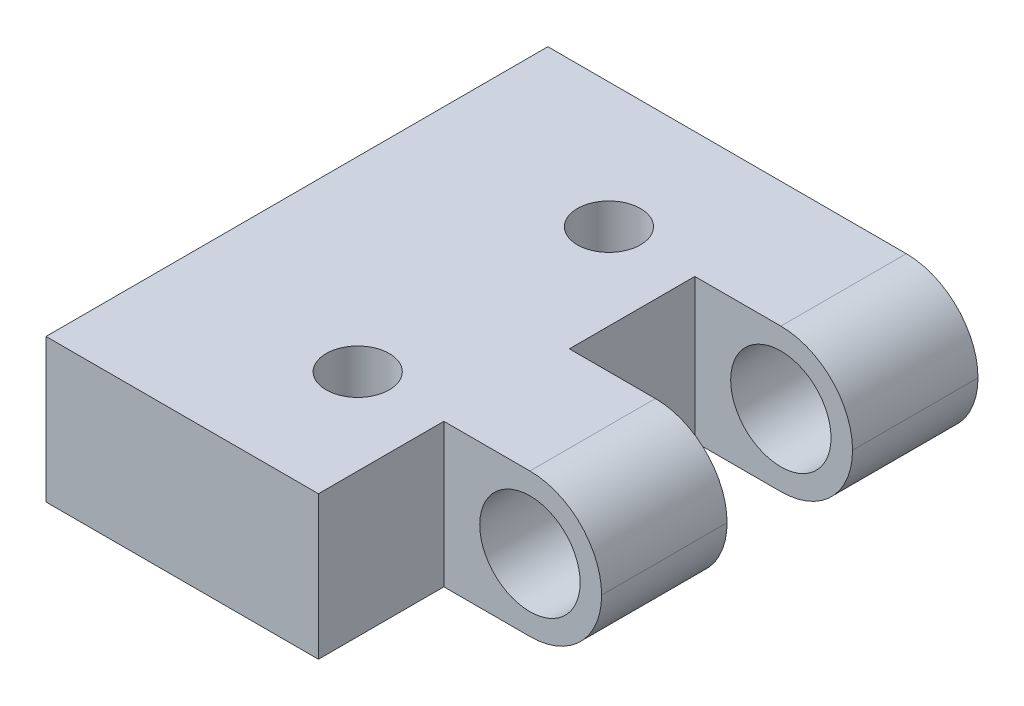
ISO-10303-21;
HEADER;
FILE_DESCRIPTION(('STEP AP214'),'2;1');
FILE_NAME('part.step','',(''),(''),'','','');
FILE_SCHEMA(('AUTOMOTIVE_DESIGN { 1 0 10303 214 1 1 1 1 }'));
ENDSEC;
DATA;
#1=APPLICATION_CONTEXT('core data for automotive mechanical design processes');
#2=APPLICATION_PROTOCOL_DEFINITION('international standard','automotive_design',2000,#1);
#3=PRODUCT_CONTEXT('',#1,'mechanical');
#4=PRODUCT('Part','Part','',(#3));
#5=PRODUCT_RELATED_PRODUCT_CATEGORY('part','',(#4));
#6=PRODUCT_DEFINITION_FORMATION('','',#4);
#7=PRODUCT_DEFINITION_CONTEXT('part definition',#1,'design');
#8=PRODUCT_DEFINITION('design','',#6,#7);
#9=PRODUCT_DEFINITION_SHAPE('','',#8);
#10=(LENGTH_UNIT() NAMED_UNIT(*) SI_UNIT(.MILLI.,.METRE.));
#11=(NAMED_UNIT(*) PLANE_ANGLE_UNIT() SI_UNIT($,.RADIAN.));
#12=(NAMED_UNIT(*) SI_UNIT($,.STERADIAN.) SOLID_ANGLE_UNIT());
#13=UNCERTAINTY_MEASURE_WITH_UNIT(LENGTH_MEASURE(1.E-05),#10,'distance_accuracy_value','');
#14=(GEOMETRIC_REPRESENTATION_CONTEXT(3) GLOBAL_UNCERTAINTY_ASSIGNED_CONTEXT((#13)) GLOBAL_UNIT_ASSIGNED_CONTEXT((#10,
#11,#12)) REPRESENTATION_CONTEXT('',''));
#15=CARTESIAN_POINT('',(0.,0.,0.));
#16=DIRECTION('',(0.,0.,1.));
#17=DIRECTION('',(1.,0.,0.));
#18=AXIS2_PLACEMENT_3D('',#15,#16,#17);
#19=CARTESIAN_POINT('',(0.,0.,0.));
#20=DIRECTION('',(0.,-1.,0.));
#21=DIRECTION('',(0.,0.,-1.));
#22=AXIS2_PLACEMENT_3D('',#19,#20,#21);
#23=PLANE('',#22);
#24=DIRECTION('',(0.,0.,1.));
#25=VECTOR('',#24,1.);
#26=CARTESIAN_POINT('',(12.065,0.,0.));
#27=LINE('',#26,#25);
#28=CARTESIAN_POINT('',(12.065,0.,-5.55625));
#29=VERTEX_POINT('',#28);
#30=CARTESIAN_POINT('',(12.065,0.,0.));
#31=VERTEX_POINT('',#30);
#32=EDGE_CURVE('E136',#29,#31,#27,.T.);
#33=ORIENTED_EDGE('',*,*,#32,.T.);
#34=DIRECTION('',(1.,0.,0.));
#35=VECTOR('',#34,1.);
#36=CARTESIAN_POINT('',(0.,0.,0.));
#37=LINE('',#36,#35);
#38=CARTESIAN_POINT('',(0.,0.,0.));
#39=VERTEX_POINT('',#38);
#40=EDGE_CURVE('E150',#39,#31,#37,.T.);
#41=ORIENTED_EDGE('',*,*,#40,.F.);
#42=DIRECTION('',(0.,0.,1.));
#43=VECTOR('',#42,1.);
#44=CARTESIAN_POINT('',(0.,0.,0.));
#45=LINE('',#44,#43);
#46=CARTESIAN_POINT('',(0.,0.,-22.225));
#47=VERTEX_POINT('',#46);
#48=EDGE_CURVE('E162',#47,#39,#45,.T.);
#49=ORIENTED_EDGE('',*,*,#48,.F.);
#50=DIRECTION('',(-1.,0.,0.));
#51=VECTOR('',#50,1.);
#52=CARTESIAN_POINT('',(0.,0.,-22.225));
#53=LINE('',#52,#51);
#54=CARTESIAN_POINT('',(15.875,0.,-22.225));
#55=VERTEX_POINT('',#54);
#56=EDGE_CURVE('E161',#55,#47,#53,.T.);
#57=ORIENTED_EDGE('',*,*,#56,.F.);
#58=DIRECTION('',(0.,0.,-1.));
#59=VECTOR('',#58,1.);
#60=CARTESIAN_POINT('',(15.875,0.,0.));
#61=LINE('',#60,#59);
#62=CARTESIAN_POINT('',(15.875,0.,-16.66875));
#63=VERTEX_POINT('',#62);
#64=EDGE_CURVE('E191',#55,#63,#61,.F.);
#65=ORIENTED_EDGE('',*,*,#64,.T.);
#66=DIRECTION('',(-1.,0.,0.));
#67=VECTOR('',#66,1.);
#68=CARTESIAN_POINT('',(12.065,0.,-16.66875));
#69=LINE('',#68,#67);
#70=CARTESIAN_POINT('',(12.065,0.,-16.66875));
#71=VERTEX_POINT('',#70);
#72=EDGE_CURVE('E267',#63,#71,#69,.T.);
#73=ORIENTED_EDGE('',*,*,#72,.T.);
#74=DIRECTION('',(0.,0.,1.));
#75=VECTOR('',#74,1.);
#76=CARTESIAN_POINT('',(12.065,0.,-11.1125));
#77=LINE('',#76,#75);
#78=CARTESIAN_POINT('',(12.065,0.,-11.1125));
#79=VERTEX_POINT('',#78);
#80=EDGE_CURVE('E222',#71,#79,#77,.T.);
#81=ORIENTED_EDGE('',*,*,#80,.T.);
#82=DIRECTION('',(1.,0.,0.));
#83=VECTOR('',#82,1.);
#84=CARTESIAN_POINT('',(12.065,0.,-11.1125));
#85=LINE('',#84,#83);
#86=CARTESIAN_POINT('',(15.875,0.,-11.1125));
#87=VERTEX_POINT('',#86);
#88=EDGE_CURVE('E263',#79,#87,#85,.T.);
#89=ORIENTED_EDGE('',*,*,#88,.T.);
#90=CARTESIAN_POINT('',(15.875,0.,-5.55625));
#91=VERTEX_POINT('',#90);
#92=EDGE_CURVE('E190',#87,#91,#61,.F.);
#93=ORIENTED_EDGE('',*,*,#92,.T.);
#94=DIRECTION('',(-1.,0.,0.));
#95=VECTOR('',#94,1.);
#96=CARTESIAN_POINT('',(12.065,0.,-5.55625));
#97=LINE('',#96,#95);
#98=EDGE_CURVE('E145',#91,#29,#97,.T.);
#99=ORIENTED_EDGE('',*,*,#98,.T.);
#100=EDGE_LOOP('',(#33,#41,#49,#57,#65,#73,#81,#89,#93,#99));
#101=FACE_BOUND('',#100,.T.);
#102=CARTESIAN_POINT('',(8.255,0.,-16.6751));
#103=DIRECTION('',(0.,1.,0.));
#104=DIRECTION('',(0.,0.,1.));
#105=AXIS2_PLACEMENT_3D('',#102,#103,#104);
#106=CIRCLE('',#105,1.397);
#107=CARTESIAN_POINT('',(8.255,0.,-15.2781));
#108=VERTEX_POINT('',#107);
#109=EDGE_CURVE('E279',#108,#108,#106,.T.);
#110=ORIENTED_EDGE('',*,*,#109,.T.);
#111=EDGE_LOOP('',(#110));
#112=FACE_BOUND('',#111,.T.);
#113=CARTESIAN_POINT('',(8.255,0.,-5.5499));
#114=DIRECTION('',(0.,1.,0.));
#115=DIRECTION('',(0.,0.,1.));
#116=AXIS2_PLACEMENT_3D('',#113,#114,#115);
#117=CIRCLE('',#116,1.397);
#118=CARTESIAN_POINT('',(8.255,0.,-4.1529));
#119=VERTEX_POINT('',#118);
#120=EDGE_CURVE('E297',#119,#119,#117,.T.);
#121=ORIENTED_EDGE('',*,*,#120,.T.);
#122=EDGE_LOOP('',(#121));
#123=FACE_BOUND('',#122,.T.);
#124=ADVANCED_FACE('F43',(#101,#112,#123),#23,.T.);
#125=CARTESIAN_POINT('',(15.875,3.175,-22.225));
#126=DIRECTION('',(0.,0.,1.));
#127=DIRECTION('',(1.,0.,0.));
#128=AXIS2_PLACEMENT_3D('',#125,#126,#127);
#129=CYLINDRICAL_SURFACE('',#128,2.2225);
#130=CARTESIAN_POINT('',(15.875,3.175,-16.66875));
#131=DIRECTION('',(0.,0.,-1.));
#132=DIRECTION('',(-1.,0.,0.));
#133=AXIS2_PLACEMENT_3D('',#130,#131,#132);
#134=CIRCLE('',#133,2.2225);
#135=CARTESIAN_POINT('',(13.6525,3.175,-16.66875));
#136=VERTEX_POINT('',#135);
#137=EDGE_CURVE('E247',#136,#136,#134,.F.);
#138=ORIENTED_EDGE('',*,*,#137,.T.);
#139=EDGE_LOOP('',(#138));
#140=FACE_BOUND('',#139,.T.);
#141=CARTESIAN_POINT('',(15.875,3.175,-22.225));
#142=DIRECTION('',(0.,0.,1.));
#143=DIRECTION('',(1.,0.,0.));
#144=AXIS2_PLACEMENT_3D('',#141,#142,#143);
#145=CIRCLE('',#144,2.2225);
#146=CARTESIAN_POINT('',(18.0975,3.175,-22.225));
#147=VERTEX_POINT('',#146);
#148=EDGE_CURVE('E168',#147,#147,#145,.T.);
#149=ORIENTED_EDGE('',*,*,#148,.F.);
#150=EDGE_LOOP('',(#149));
#151=FACE_BOUND('',#150,.T.);
#152=ADVANCED_FACE('F326',(#140,#151),#129,.F.);
#153=CARTESIAN_POINT('',(15.875,3.175,0.));
#154=DIRECTION('',(0.,0.,1.));
#155=DIRECTION('',(1.,0.,0.));
#156=AXIS2_PLACEMENT_3D('',#153,#154,#155);
#157=CYLINDRICAL_SURFACE('',#156,3.175);
#158=CARTESIAN_POINT('',(15.875,3.175,-16.66875));
#159=DIRECTION('',(0.,0.,-1.));
#160=DIRECTION('',(-1.,0.,0.));
#161=AXIS2_PLACEMENT_3D('',#158,#159,#160);
#162=CIRCLE('',#161,3.175);
#163=CARTESIAN_POINT('',(19.05,3.175,-16.66875));
#164=VERTEX_POINT('',#163);
#165=EDGE_CURVE('E211',#63,#164,#162,.F.);
#166=ORIENTED_EDGE('',*,*,#165,.F.);
#167=ORIENTED_EDGE('',*,*,#64,.F.);
#168=CARTESIAN_POINT('',(15.875,3.175,-22.225));
#169=DIRECTION('',(0.,0.,1.));
#170=DIRECTION('',(1.,0.,0.));
#171=AXIS2_PLACEMENT_3D('',#168,#169,#170);
#172=CIRCLE('',#171,3.175);
#173=CARTESIAN_POINT('',(19.05,3.175,-22.225));
#174=VERTEX_POINT('',#173);
#175=EDGE_CURVE('E183',#174,#55,#172,.F.);
#176=ORIENTED_EDGE('',*,*,#175,.F.);
#177=DIRECTION('',(0.,0.,-1.));
#178=VECTOR('',#177,1.);
#179=CARTESIAN_POINT('',(19.05,3.175,-22.225));
#180=LINE('',#179,#178);
#181=EDGE_CURVE('E196',#164,#174,#180,.T.);
#182=ORIENTED_EDGE('',*,*,#181,.F.);
#183=EDGE_LOOP('',(#166,#167,#176,#182));
#184=FACE_BOUND('',#183,.T.);
#185=ADVANCED_FACE('F334',(#184),#157,.T.);
#186=CARTESIAN_POINT('',(15.875,3.175,0.));
#187=DIRECTION('',(0.,0.,-1.));
#188=DIRECTION('',(-1.,0.,0.));
#189=AXIS2_PLACEMENT_3D('',#186,#187,#188);
#190=CYLINDRICAL_SURFACE('',#189,3.175);
#191=CARTESIAN_POINT('',(15.875,3.175,-16.66875));
#192=DIRECTION('',(0.,0.,-1.));
#193=DIRECTION('',(-1.,0.,0.));
#194=AXIS2_PLACEMENT_3D('',#191,#192,#193);
#195=CIRCLE('',#194,3.175);
#196=CARTESIAN_POINT('',(15.875,6.35,-16.66875));
#197=VERTEX_POINT('',#196);
#198=EDGE_CURVE('E52',#164,#197,#195,.F.);
#199=ORIENTED_EDGE('',*,*,#198,.F.);
#200=ORIENTED_EDGE('',*,*,#181,.T.);
#201=CARTESIAN_POINT('',(15.875,3.175,-22.225));
#202=DIRECTION('',(0.,0.,1.));
#203=DIRECTION('',(1.,0.,0.));
#204=AXIS2_PLACEMENT_3D('',#201,#202,#203);
#205=CIRCLE('',#204,3.175);
#206=CARTESIAN_POINT('',(15.875,6.35,-22.225));
#207=VERTEX_POINT('',#206);
#208=EDGE_CURVE('E186',#207,#174,#205,.F.);
#209=ORIENTED_EDGE('',*,*,#208,.F.);
#210=DIRECTION('',(0.,0.,-1.));
#211=VECTOR('',#210,1.);
#212=CARTESIAN_POINT('',(15.875,6.35,0.));
#213=LINE('',#212,#211);
#214=EDGE_CURVE('E179',#197,#207,#213,.T.);
#215=ORIENTED_EDGE('',*,*,#214,.F.);
#216=EDGE_LOOP('',(#199,#200,#209,#215));
#217=FACE_BOUND('',#216,.T.);
#218=ADVANCED_FACE('F224',(#217),#190,.T.);
#219=CARTESIAN_POINT('',(0.,6.35,0.));
#220=DIRECTION('',(1.,0.,0.));
#221=DIRECTION('',(0.,0.,-1.));
#222=AXIS2_PLACEMENT_3D('',#219,#220,#221);
#223=PLANE('',#222);
#224=ORIENTED_EDGE('',*,*,#48,.T.);
#225=DIRECTION('',(0.,-1.,0.));
#226=VECTOR('',#225,1.);
#227=CARTESIAN_POINT('',(0.,6.35,0.));
#228=LINE('',#227,#226);
#229=CARTESIAN_POINT('',(0.,6.35,0.));
#230=VERTEX_POINT('',#229);
#231=EDGE_CURVE('E158',#230,#39,#228,.T.);
#232=ORIENTED_EDGE('',*,*,#231,.F.);
#233=DIRECTION('',(0.,0.,1.));
#234=VECTOR('',#233,1.);
#235=CARTESIAN_POINT('',(0.,6.35,0.));
#236=LINE('',#235,#234);
#237=CARTESIAN_POINT('',(0.,6.35,-22.225));
#238=VERTEX_POINT('',#237);
#239=EDGE_CURVE('E166',#238,#230,#236,.T.);
#240=ORIENTED_EDGE('',*,*,#239,.F.);
#241=DIRECTION('',(0.,-1.,0.));
#242=VECTOR('',#241,1.);
#243=CARTESIAN_POINT('',(0.,6.35,-22.225));
#244=LINE('',#243,#242);
#245=EDGE_CURVE('E172',#238,#47,#244,.T.);
#246=ORIENTED_EDGE('',*,*,#245,.T.);
#247=EDGE_LOOP('',(#224,#232,#240,#246));
#248=FACE_BOUND('',#247,.T.);
#249=ADVANCED_FACE('F342',(#248),#223,.F.);
#250=CARTESIAN_POINT('',(0.,6.35,0.));
#251=DIRECTION('',(0.,0.,-1.));
#252=DIRECTION('',(-1.,0.,0.));
#253=AXIS2_PLACEMENT_3D('',#250,#251,#252);
#254=PLANE('',#253);
#255=ORIENTED_EDGE('',*,*,#40,.T.);
#256=DIRECTION('',(0.,1.,0.));
#257=VECTOR('',#256,1.);
#258=CARTESIAN_POINT('',(12.065,0.,0.));
#259=LINE('',#258,#257);
#260=CARTESIAN_POINT('',(12.065,6.35,0.));
#261=VERTEX_POINT('',#260);
#262=EDGE_CURVE('E132',#31,#261,#259,.T.);
#263=ORIENTED_EDGE('',*,*,#262,.T.);
#264=DIRECTION('',(1.,0.,0.));
#265=VECTOR('',#264,1.);
#266=CARTESIAN_POINT('',(0.,6.35,0.));
#267=LINE('',#266,#265);
#268=EDGE_CURVE('E233',#230,#261,#267,.T.);
#269=ORIENTED_EDGE('',*,*,#268,.F.);
#270=ORIENTED_EDGE('',*,*,#231,.T.);
#271=EDGE_LOOP('',(#255,#263,#269,#270));
#272=FACE_BOUND('',#271,.T.);
#273=ADVANCED_FACE('F156',(#272),#254,.F.);
#274=CARTESIAN_POINT('',(0.,6.35,-22.225));
#275=DIRECTION('',(0.,0.,1.));
#276=DIRECTION('',(1.,0.,0.));
#277=AXIS2_PLACEMENT_3D('',#274,#275,#276);
#278=PLANE('',#277);
#279=ORIENTED_EDGE('',*,*,#148,.T.);
#280=EDGE_LOOP('',(#279));
#281=FACE_BOUND('',#280,.T.);
#282=DIRECTION('',(-1.,0.,0.));
#283=VECTOR('',#282,1.);
#284=CARTESIAN_POINT('',(0.,6.35,-22.225));
#285=LINE('',#284,#283);
#286=EDGE_CURVE('E176',#207,#238,#285,.T.);
#287=ORIENTED_EDGE('',*,*,#286,.F.);
#288=ORIENTED_EDGE('',*,*,#208,.T.);
#289=ORIENTED_EDGE('',*,*,#175,.T.);
#290=ORIENTED_EDGE('',*,*,#56,.T.);
#291=ORIENTED_EDGE('',*,*,#245,.F.);
#292=EDGE_LOOP('',(#287,#288,#289,#290,#291));
#293=FACE_BOUND('',#292,.T.);
#294=ADVANCED_FACE('F229',(#281,#293),#278,.F.);
#295=CARTESIAN_POINT('',(0.,6.35,0.));
#296=DIRECTION('',(0.,-1.,0.));
#297=DIRECTION('',(0.,0.,-1.));
#298=AXIS2_PLACEMENT_3D('',#295,#296,#297);
#299=PLANE('',#298);
#300=CARTESIAN_POINT('',(8.255,6.35,-5.5499));
#301=DIRECTION('',(0.,1.,0.));
#302=DIRECTION('',(0.,0.,1.));
#303=AXIS2_PLACEMENT_3D('',#300,#301,#302);
#304=CIRCLE('',#303,1.397);
#305=CARTESIAN_POINT('',(8.255,6.35,-4.1529));
#306=VERTEX_POINT('',#305);
#307=EDGE_CURVE('E301',#306,#306,#304,.T.);
#308=ORIENTED_EDGE('',*,*,#307,.F.);
#309=EDGE_LOOP('',(#308));
#310=FACE_BOUND('',#309,.T.);
#311=CARTESIAN_POINT('',(8.255,6.35,-16.6751));
#312=DIRECTION('',(0.,1.,0.));
#313=DIRECTION('',(0.,0.,1.));
#314=AXIS2_PLACEMENT_3D('',#311,#312,#313);
#315=CIRCLE('',#314,1.397);
#316=CARTESIAN_POINT('',(8.255,6.35,-15.2781));
#317=VERTEX_POINT('',#316);
#318=EDGE_CURVE('E293',#317,#317,#315,.T.);
#319=ORIENTED_EDGE('',*,*,#318,.F.);
#320=EDGE_LOOP('',(#319));
#321=FACE_BOUND('',#320,.T.);
#322=ORIENTED_EDGE('',*,*,#268,.T.);
#323=DIRECTION('',(0.,0.,1.));
#324=VECTOR('',#323,1.);
#325=CARTESIAN_POINT('',(12.065,6.35,0.));
#326=LINE('',#325,#324);
#327=CARTESIAN_POINT('',(12.065,6.35,-5.55625));
#328=VERTEX_POINT('',#327);
#329=EDGE_CURVE('E139',#328,#261,#326,.T.);
#330=ORIENTED_EDGE('',*,*,#329,.F.);
#331=DIRECTION('',(-1.,0.,0.));
#332=VECTOR('',#331,1.);
#333=CARTESIAN_POINT('',(12.065,6.35,-5.55625));
#334=LINE('',#333,#332);
#335=CARTESIAN_POINT('',(15.875,6.35,-5.55625));
#336=VERTEX_POINT('',#335);
#337=EDGE_CURVE('E154',#336,#328,#334,.T.);
#338=ORIENTED_EDGE('',*,*,#337,.F.);
#339=CARTESIAN_POINT('',(15.875,6.35,-11.1125));
#340=VERTEX_POINT('',#339);
#341=EDGE_CURVE('E182',#336,#340,#213,.T.);
#342=ORIENTED_EDGE('',*,*,#341,.T.);
#343=DIRECTION('',(1.,0.,0.));
#344=VECTOR('',#343,1.);
#345=CARTESIAN_POINT('',(12.065,6.35,-11.1125));
#346=LINE('',#345,#344);
#347=CARTESIAN_POINT('',(12.065,6.35,-11.1125));
#348=VERTEX_POINT('',#347);
#349=EDGE_CURVE('E59',#348,#340,#346,.T.);
#350=ORIENTED_EDGE('',*,*,#349,.F.);
#351=DIRECTION('',(0.,0.,1.));
#352=VECTOR('',#351,1.);
#353=CARTESIAN_POINT('',(12.065,6.35,-11.1125));
#354=LINE('',#353,#352);
#355=CARTESIAN_POINT('',(12.065,6.35,-16.66875));
#356=VERTEX_POINT('',#355);
#357=EDGE_CURVE('E220',#356,#348,#354,.T.);
#358=ORIENTED_EDGE('',*,*,#357,.F.);
#359=DIRECTION('',(-1.,0.,0.));
#360=VECTOR('',#359,1.);
#361=CARTESIAN_POINT('',(12.065,6.35,-16.66875));
#362=LINE('',#361,#360);
#363=EDGE_CURVE('E208',#197,#356,#362,.T.);
#364=ORIENTED_EDGE('',*,*,#363,.F.);
#365=ORIENTED_EDGE('',*,*,#214,.T.);
#366=ORIENTED_EDGE('',*,*,#286,.T.);
#367=ORIENTED_EDGE('',*,*,#239,.T.);
#368=EDGE_LOOP('',(#322,#330,#338,#342,#350,#358,#364,#365,#366,#367));
#369=FACE_BOUND('',#368,.T.);
#370=ADVANCED_FACE('F217',(#310,#321,#369),#299,.F.);
#371=CARTESIAN_POINT('',(15.875,3.175,-5.55625));
#372=DIRECTION('',(0.,0.,-1.));
#373=DIRECTION('',(-1.,0.,0.));
#374=AXIS2_PLACEMENT_3D('',#371,#372,#373);
#375=CIRCLE('',#374,3.175);
#376=CARTESIAN_POINT('',(19.05,3.175,-5.55625));
#377=VERTEX_POINT('',#376);
#378=EDGE_CURVE('E66',#91,#377,#375,.F.);
#379=ORIENTED_EDGE('',*,*,#378,.F.);
#380=ORIENTED_EDGE('',*,*,#92,.F.);
#381=CARTESIAN_POINT('',(15.875,3.175,-11.1125));
#382=DIRECTION('',(0.,0.,1.));
#383=DIRECTION('',(1.,0.,0.));
#384=AXIS2_PLACEMENT_3D('',#381,#382,#383);
#385=CIRCLE('',#384,3.175);
#386=CARTESIAN_POINT('',(19.05,3.175,-11.1125));
#387=VERTEX_POINT('',#386);
#388=EDGE_CURVE('E257',#387,#87,#385,.F.);
#389=ORIENTED_EDGE('',*,*,#388,.F.);
#390=EDGE_CURVE('E199',#377,#387,#180,.T.);
#391=ORIENTED_EDGE('',*,*,#390,.F.);
#392=EDGE_LOOP('',(#379,#380,#389,#391));
#393=FACE_BOUND('',#392,.T.);
#394=ADVANCED_FACE('F45',(#393),#157,.T.);
#395=CARTESIAN_POINT('',(15.875,3.175,-5.55625));
#396=DIRECTION('',(0.,0.,-1.));
#397=DIRECTION('',(-1.,0.,0.));
#398=AXIS2_PLACEMENT_3D('',#395,#396,#397);
#399=CIRCLE('',#398,3.175);
#400=EDGE_CURVE('E11',#377,#336,#399,.F.);
#401=ORIENTED_EDGE('',*,*,#400,.F.);
#402=ORIENTED_EDGE('',*,*,#390,.T.);
#403=CARTESIAN_POINT('',(15.875,3.175,-11.1125));
#404=DIRECTION('',(0.,0.,1.));
#405=DIRECTION('',(1.,0.,0.));
#406=AXIS2_PLACEMENT_3D('',#403,#404,#405);
#407=CIRCLE('',#406,3.175);
#408=EDGE_CURVE('E195',#340,#387,#407,.F.);
#409=ORIENTED_EDGE('',*,*,#408,.F.);
#410=ORIENTED_EDGE('',*,*,#341,.F.);
#411=EDGE_LOOP('',(#401,#402,#409,#410));
#412=FACE_BOUND('',#411,.T.);
#413=ADVANCED_FACE('F345',(#412),#190,.T.);
#414=CARTESIAN_POINT('',(12.065,0.,-16.66875));
#415=DIRECTION('',(0.,0.,-1.));
#416=DIRECTION('',(-1.,0.,0.));
#417=AXIS2_PLACEMENT_3D('',#414,#415,#416);
#418=PLANE('',#417);
#419=ORIENTED_EDGE('',*,*,#165,.T.);
#420=ORIENTED_EDGE('',*,*,#198,.T.);
#421=ORIENTED_EDGE('',*,*,#363,.T.);
#422=DIRECTION('',(0.,1.,0.));
#423=VECTOR('',#422,1.);
#424=CARTESIAN_POINT('',(12.065,0.,-16.66875));
#425=LINE('',#424,#423);
#426=EDGE_CURVE('E276',#71,#356,#425,.T.);
#427=ORIENTED_EDGE('',*,*,#426,.F.);
#428=ORIENTED_EDGE('',*,*,#72,.F.);
#429=EDGE_LOOP('',(#419,#420,#421,#427,#428));
#430=FACE_BOUND('',#429,.T.);
#431=ORIENTED_EDGE('',*,*,#137,.F.);
#432=EDGE_LOOP('',(#431));
#433=FACE_BOUND('',#432,.T.);
#434=ADVANCED_FACE('F206',(#430,#433),#418,.F.);
#435=CARTESIAN_POINT('',(12.065,0.,-11.1125));
#436=DIRECTION('',(0.,0.,1.));
#437=DIRECTION('',(1.,0.,0.));
#438=AXIS2_PLACEMENT_3D('',#435,#436,#437);
#439=PLANE('',#438);
#440=ORIENTED_EDGE('',*,*,#388,.T.);
#441=ORIENTED_EDGE('',*,*,#88,.F.);
#442=DIRECTION('',(0.,1.,0.));
#443=VECTOR('',#442,1.);
#444=CARTESIAN_POINT('',(12.065,0.,-11.1125));
#445=LINE('',#444,#443);
#446=EDGE_CURVE('E271',#79,#348,#445,.T.);
#447=ORIENTED_EDGE('',*,*,#446,.T.);
#448=ORIENTED_EDGE('',*,*,#349,.T.);
#449=ORIENTED_EDGE('',*,*,#408,.T.);
#450=EDGE_LOOP('',(#440,#441,#447,#448,#449));
#451=FACE_BOUND('',#450,.T.);
#452=CARTESIAN_POINT('',(15.875,3.175,-11.1125));
#453=DIRECTION('',(0.,0.,1.));
#454=DIRECTION('',(1.,0.,0.));
#455=AXIS2_PLACEMENT_3D('',#452,#453,#454);
#456=CIRCLE('',#455,2.2225);
#457=CARTESIAN_POINT('',(18.0975,3.175,-11.1125));
#458=VERTEX_POINT('',#457);
#459=EDGE_CURVE('E253',#458,#458,#456,.F.);
#460=ORIENTED_EDGE('',*,*,#459,.F.);
#461=EDGE_LOOP('',(#460));
#462=FACE_BOUND('',#461,.T.);
#463=ADVANCED_FACE('F352',(#451,#462),#439,.F.);
#464=CARTESIAN_POINT('',(12.065,0.,-11.1125));
#465=DIRECTION('',(-1.,0.,0.));
#466=DIRECTION('',(0.,0.,1.));
#467=AXIS2_PLACEMENT_3D('',#464,#465,#466);
#468=PLANE('',#467);
#469=ORIENTED_EDGE('',*,*,#357,.T.);
#470=ORIENTED_EDGE('',*,*,#446,.F.);
#471=ORIENTED_EDGE('',*,*,#80,.F.);
#472=ORIENTED_EDGE('',*,*,#426,.T.);
#473=EDGE_LOOP('',(#469,#470,#471,#472));
#474=FACE_BOUND('',#473,.T.);
#475=ADVANCED_FACE('F378',(#474),#468,.F.);
#476=CARTESIAN_POINT('',(12.065,0.,-5.55625));
#477=DIRECTION('',(0.,0.,-1.));
#478=DIRECTION('',(-1.,0.,0.));
#479=AXIS2_PLACEMENT_3D('',#476,#477,#478);
#480=PLANE('',#479);
#481=ORIENTED_EDGE('',*,*,#378,.T.);
#482=ORIENTED_EDGE('',*,*,#400,.T.);
#483=ORIENTED_EDGE('',*,*,#337,.T.);
#484=DIRECTION('',(0.,1.,0.));
#485=VECTOR('',#484,1.);
#486=CARTESIAN_POINT('',(12.065,0.,-5.55625));
#487=LINE('',#486,#485);
#488=EDGE_CURVE('E144',#29,#328,#487,.T.);
#489=ORIENTED_EDGE('',*,*,#488,.F.);
#490=ORIENTED_EDGE('',*,*,#98,.F.);
#491=EDGE_LOOP('',(#481,#482,#483,#489,#490));
#492=FACE_BOUND('',#491,.T.);
#493=CARTESIAN_POINT('',(15.875,3.175,-5.55625));
#494=DIRECTION('',(0.,0.,-1.));
#495=DIRECTION('',(-1.,0.,0.));
#496=AXIS2_PLACEMENT_3D('',#493,#494,#495);
#497=CIRCLE('',#496,2.2225);
#498=CARTESIAN_POINT('',(13.6525,3.175,-5.55625));
#499=VERTEX_POINT('',#498);
#500=EDGE_CURVE('E200',#499,#499,#497,.F.);
#501=ORIENTED_EDGE('',*,*,#500,.F.);
#502=EDGE_LOOP('',(#501));
#503=FACE_BOUND('',#502,.T.);
#504=ADVANCED_FACE('F380',(#492,#503),#480,.F.);
#505=CARTESIAN_POINT('',(12.065,0.,0.));
#506=DIRECTION('',(-1.,0.,0.));
#507=DIRECTION('',(0.,0.,1.));
#508=AXIS2_PLACEMENT_3D('',#505,#506,#507);
#509=PLANE('',#508);
#510=ORIENTED_EDGE('',*,*,#329,.T.);
#511=ORIENTED_EDGE('',*,*,#262,.F.);
#512=ORIENTED_EDGE('',*,*,#32,.F.);
#513=ORIENTED_EDGE('',*,*,#488,.T.);
#514=EDGE_LOOP('',(#510,#511,#512,#513));
#515=FACE_BOUND('',#514,.T.);
#516=ADVANCED_FACE('F134',(#515),#509,.F.);
#517=ORIENTED_EDGE('',*,*,#500,.T.);
#518=EDGE_LOOP('',(#517));
#519=FACE_BOUND('',#518,.T.);
#520=ORIENTED_EDGE('',*,*,#459,.T.);
#521=EDGE_LOOP('',(#520));
#522=FACE_BOUND('',#521,.T.);
#523=ADVANCED_FACE('F315',(#519,#522),#129,.F.);
#524=CARTESIAN_POINT('',(8.255,6.35,-16.6751));
#525=DIRECTION('',(0.,1.,0.));
#526=DIRECTION('',(0.,0.,1.));
#527=AXIS2_PLACEMENT_3D('',#524,#525,#526);
#528=CYLINDRICAL_SURFACE('',#527,1.397);
#529=ORIENTED_EDGE('',*,*,#109,.F.);
#530=EDGE_LOOP('',(#529));
#531=FACE_BOUND('',#530,.T.);
#532=ORIENTED_EDGE('',*,*,#318,.T.);
#533=EDGE_LOOP('',(#532));
#534=FACE_BOUND('',#533,.T.);
#535=ADVANCED_FACE('F313',(#531,#534),#528,.F.);
#536=CARTESIAN_POINT('',(8.255,6.35,-5.5499));
#537=DIRECTION('',(0.,1.,0.));
#538=DIRECTION('',(0.,0.,1.));
#539=AXIS2_PLACEMENT_3D('',#536,#537,#538);
#540=CYLINDRICAL_SURFACE('',#539,1.397);
#541=ORIENTED_EDGE('',*,*,#120,.F.);
#542=EDGE_LOOP('',(#541));
#543=FACE_BOUND('',#542,.T.);
#544=ORIENTED_EDGE('',*,*,#307,.T.);
#545=EDGE_LOOP('',(#544));
#546=FACE_BOUND('',#545,.T.);
#547=ADVANCED_FACE('F306',(#543,#546),#540,.F.);
#548=CLOSED_SHELL('',(#124,#152,#185,#218,#249,#273,#294,#370,#394,#413,#434,#463,#475,#504,
#516,#523,#535,#547));
#549=MANIFOLD_SOLID_BREP('B2',#548);
#550=ADVANCED_BREP_SHAPE_REPRESENTATION('',(#18,#549),#14);
#551=SHAPE_DEFINITION_REPRESENTATION(#9,#550);
ENDSEC;
END-ISO-10303-21;
